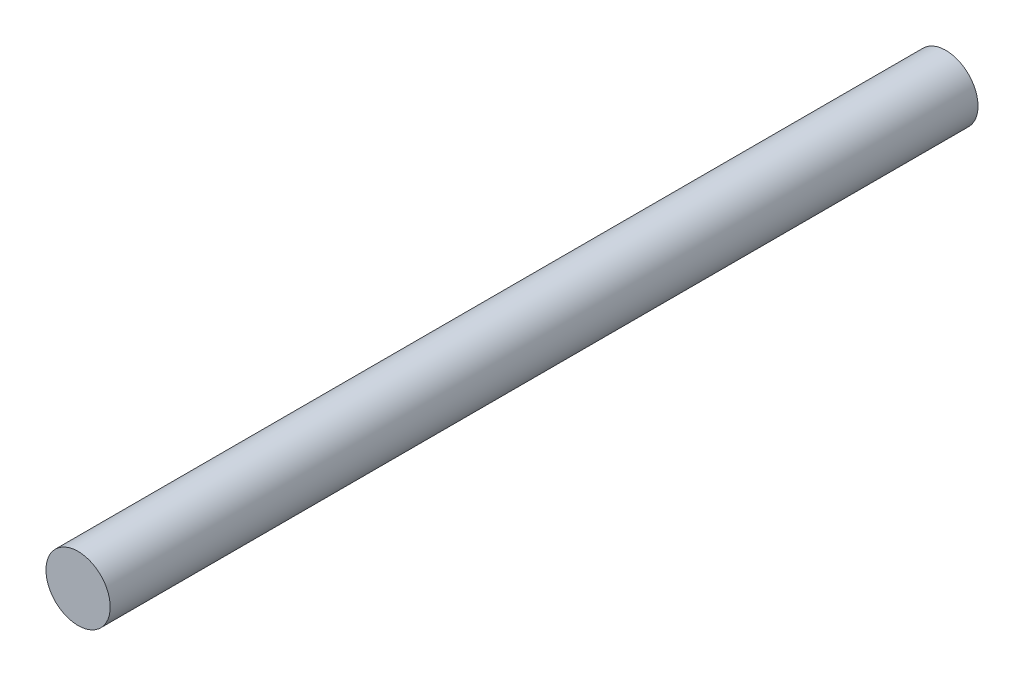
ISO-10303-21;
HEADER;
FILE_DESCRIPTION(('STEP AP214'),'2;1');
FILE_NAME('part.step','',(''),(''),'','','');
FILE_SCHEMA(('AUTOMOTIVE_DESIGN { 1 0 10303 214 1 1 1 1 }'));
ENDSEC;
DATA;
#1=APPLICATION_CONTEXT('core data for automotive mechanical design processes');
#2=APPLICATION_PROTOCOL_DEFINITION('international standard','automotive_design',2000,#1);
#3=PRODUCT_CONTEXT('',#1,'mechanical');
#4=PRODUCT('Part','Part','',(#3));
#5=PRODUCT_RELATED_PRODUCT_CATEGORY('part','',(#4));
#6=PRODUCT_DEFINITION_FORMATION('','',#4);
#7=PRODUCT_DEFINITION_CONTEXT('part definition',#1,'design');
#8=PRODUCT_DEFINITION('design','',#6,#7);
#9=PRODUCT_DEFINITION_SHAPE('','',#8);
#10=(LENGTH_UNIT() NAMED_UNIT(*) SI_UNIT(.MILLI.,.METRE.));
#11=(NAMED_UNIT(*) PLANE_ANGLE_UNIT() SI_UNIT($,.RADIAN.));
#12=(NAMED_UNIT(*) SI_UNIT($,.STERADIAN.) SOLID_ANGLE_UNIT());
#13=UNCERTAINTY_MEASURE_WITH_UNIT(LENGTH_MEASURE(1.E-05),#10,'distance_accuracy_value','');
#14=(GEOMETRIC_REPRESENTATION_CONTEXT(3) GLOBAL_UNCERTAINTY_ASSIGNED_CONTEXT((#13)) GLOBAL_UNIT_ASSIGNED_CONTEXT((#10,
#11,#12)) REPRESENTATION_CONTEXT('',''));
#15=CARTESIAN_POINT('',(0.,0.,0.));
#16=DIRECTION('',(0.,0.,1.));
#17=DIRECTION('',(1.,0.,0.));
#18=AXIS2_PLACEMENT_3D('',#15,#16,#17);
#19=CARTESIAN_POINT('',(0.,0.,54.));
#20=DIRECTION('',(0.,0.,-1.));
#21=DIRECTION('',(-1.,0.,0.));
#22=AXIS2_PLACEMENT_3D('',#19,#20,#21);
#23=CYLINDRICAL_SURFACE('',#22,2.);
#24=CARTESIAN_POINT('',(0.,0.,54.));
#25=DIRECTION('',(0.,0.,1.));
#26=DIRECTION('',(1.,0.,0.));
#27=AXIS2_PLACEMENT_3D('',#24,#25,#26);
#28=CIRCLE('',#27,2.);
#29=CARTESIAN_POINT('',(2.,0.,54.));
#30=VERTEX_POINT('',#29);
#31=EDGE_CURVE('E10',#30,#30,#28,.T.);
#32=ORIENTED_EDGE('',*,*,#31,.F.);
#33=EDGE_LOOP('',(#32));
#34=FACE_BOUND('',#33,.T.);
#35=CARTESIAN_POINT('',(0.,0.,0.));
#36=DIRECTION('',(0.,0.,1.));
#37=DIRECTION('',(1.,0.,0.));
#38=AXIS2_PLACEMENT_3D('',#35,#36,#37);
#39=CIRCLE('',#38,2.);
#40=CARTESIAN_POINT('',(2.,0.,0.));
#41=VERTEX_POINT('',#40);
#42=EDGE_CURVE('E34',#41,#41,#39,.T.);
#43=ORIENTED_EDGE('',*,*,#42,.T.);
#44=EDGE_LOOP('',(#43));
#45=FACE_BOUND('',#44,.T.);
#46=ADVANCED_FACE('F31',(#34,#45),#23,.T.);
#47=CARTESIAN_POINT('',(0.,0.,54.));
#48=DIRECTION('',(0.,0.,1.));
#49=DIRECTION('',(1.,0.,0.));
#50=AXIS2_PLACEMENT_3D('',#47,#48,#49);
#51=PLANE('',#50);
#52=ORIENTED_EDGE('',*,*,#31,.T.);
#53=EDGE_LOOP('',(#52));
#54=FACE_BOUND('',#53,.T.);
#55=ADVANCED_FACE('F46',(#54),#51,.T.);
#56=CARTESIAN_POINT('',(0.,0.,0.));
#57=DIRECTION('',(0.,0.,1.));
#58=DIRECTION('',(1.,0.,0.));
#59=AXIS2_PLACEMENT_3D('',#56,#57,#58);
#60=PLANE('',#59);
#61=ORIENTED_EDGE('',*,*,#42,.F.);
#62=EDGE_LOOP('',(#61));
#63=FACE_BOUND('',#62,.T.);
#64=ADVANCED_FACE('F44',(#63),#60,.F.);
#65=CLOSED_SHELL('',(#46,#55,#64));
#66=MANIFOLD_SOLID_BREP('B2',#65);
#67=ADVANCED_BREP_SHAPE_REPRESENTATION('',(#18,#66),#14);
#68=SHAPE_DEFINITION_REPRESENTATION(#9,#67);
ENDSEC;
END-ISO-10303-21;
